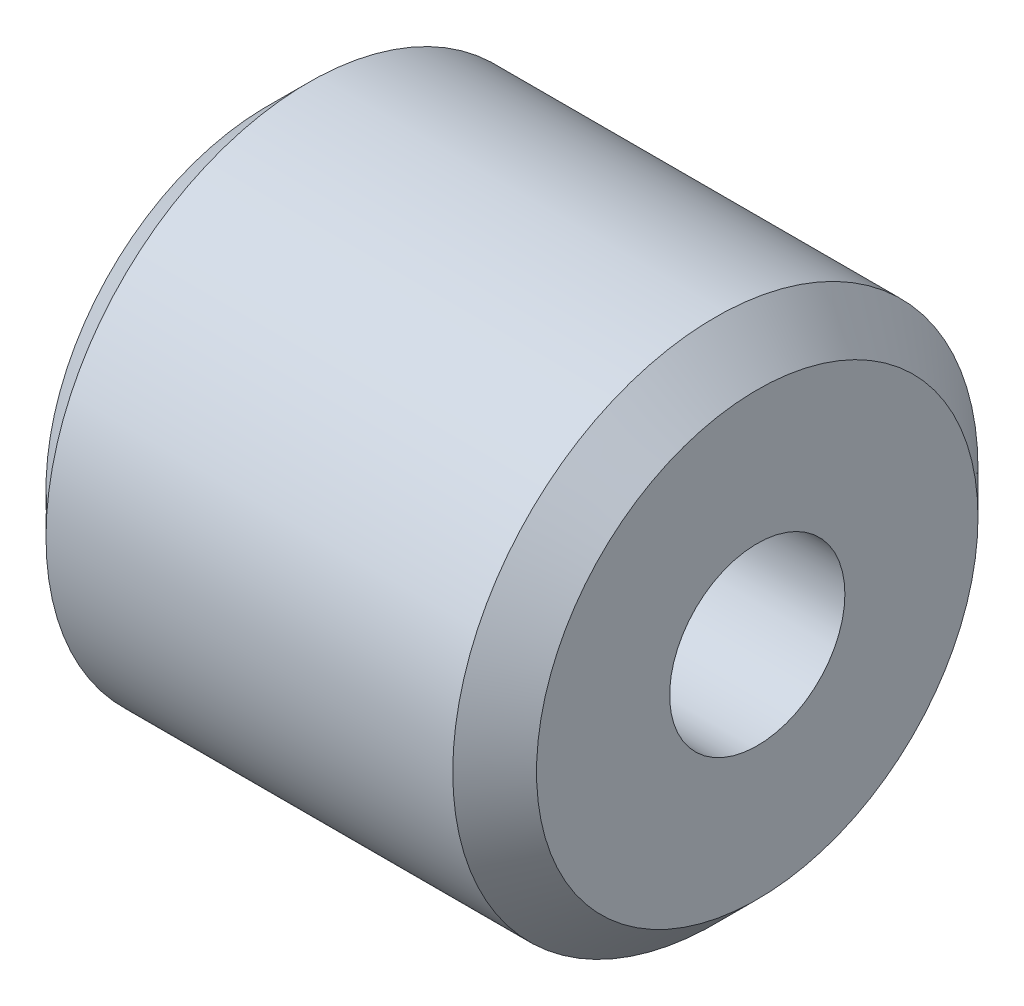
ISO-10303-21;
HEADER;
FILE_DESCRIPTION(('STEP AP214'),'2;1');
FILE_NAME('part.step','',(''),(''),'','','');
FILE_SCHEMA(('AUTOMOTIVE_DESIGN { 1 0 10303 214 1 1 1 1 }'));
ENDSEC;
DATA;
#1=APPLICATION_CONTEXT('core data for automotive mechanical design processes');
#2=APPLICATION_PROTOCOL_DEFINITION('international standard','automotive_design',2000,#1);
#3=PRODUCT_CONTEXT('',#1,'mechanical');
#4=PRODUCT('Part','Part','',(#3));
#5=PRODUCT_RELATED_PRODUCT_CATEGORY('part','',(#4));
#6=PRODUCT_DEFINITION_FORMATION('','',#4);
#7=PRODUCT_DEFINITION_CONTEXT('part definition',#1,'design');
#8=PRODUCT_DEFINITION('design','',#6,#7);
#9=PRODUCT_DEFINITION_SHAPE('','',#8);
#10=(LENGTH_UNIT() NAMED_UNIT(*) SI_UNIT(.MILLI.,.METRE.));
#11=(NAMED_UNIT(*) PLANE_ANGLE_UNIT() SI_UNIT($,.RADIAN.));
#12=(NAMED_UNIT(*) SI_UNIT($,.STERADIAN.) SOLID_ANGLE_UNIT());
#13=UNCERTAINTY_MEASURE_WITH_UNIT(LENGTH_MEASURE(1.E-05),#10,'distance_accuracy_value','');
#14=(GEOMETRIC_REPRESENTATION_CONTEXT(3) GLOBAL_UNCERTAINTY_ASSIGNED_CONTEXT((#13)) GLOBAL_UNIT_ASSIGNED_CONTEXT((#10,
#11,#12)) REPRESENTATION_CONTEXT('',''));
#15=CARTESIAN_POINT('',(0.,0.,0.));
#16=DIRECTION('',(0.,0.,1.));
#17=DIRECTION('',(1.,0.,0.));
#18=AXIS2_PLACEMENT_3D('',#15,#16,#17);
#19=CARTESIAN_POINT('',(4.45,0.,0.));
#20=DIRECTION('',(1.,0.,0.));
#21=DIRECTION('',(0.,0.,-1.));
#22=AXIS2_PLACEMENT_3D('',#19,#20,#21);
#23=PLANE('',#22);
#24=CARTESIAN_POINT('',(4.45,0.,0.));
#25=DIRECTION('',(1.,0.,0.));
#26=DIRECTION('',(0.,0.,-1.));
#27=AXIS2_PLACEMENT_3D('',#24,#25,#26);
#28=CIRCLE('',#27,4.005);
#29=CARTESIAN_POINT('',(4.45,0.,-4.005));
#30=VERTEX_POINT('',#29);
#31=EDGE_CURVE('E10',#30,#30,#28,.T.);
#32=ORIENTED_EDGE('',*,*,#31,.T.);
#33=EDGE_LOOP('',(#32));
#34=FACE_BOUND('',#33,.T.);
#35=CARTESIAN_POINT('',(4.45,0.,0.));
#36=DIRECTION('',(1.,0.,0.));
#37=DIRECTION('',(0.,0.,-1.));
#38=AXIS2_PLACEMENT_3D('',#35,#36,#37);
#39=CIRCLE('',#38,1.59);
#40=CARTESIAN_POINT('',(4.45,0.,-1.59));
#41=VERTEX_POINT('',#40);
#42=EDGE_CURVE('E64',#41,#41,#39,.T.);
#43=ORIENTED_EDGE('',*,*,#42,.F.);
#44=EDGE_LOOP('',(#43));
#45=FACE_BOUND('',#44,.T.);
#46=ADVANCED_FACE('F39',(#34,#45),#23,.T.);
#47=CARTESIAN_POINT('',(-4.45,0.,0.));
#48=DIRECTION('',(1.,0.,0.));
#49=DIRECTION('',(0.,0.,-1.));
#50=AXIS2_PLACEMENT_3D('',#47,#48,#49);
#51=PLANE('',#50);
#52=CARTESIAN_POINT('',(-4.45,0.,0.));
#53=DIRECTION('',(1.,0.,0.));
#54=DIRECTION('',(0.,0.,-1.));
#55=AXIS2_PLACEMENT_3D('',#52,#53,#54);
#56=CIRCLE('',#55,4.00499999999999);
#57=CARTESIAN_POINT('',(-4.45,0.,-4.00499999999999));
#58=VERTEX_POINT('',#57);
#59=EDGE_CURVE('E48',#58,#58,#56,.F.);
#60=ORIENTED_EDGE('',*,*,#59,.T.);
#61=EDGE_LOOP('',(#60));
#62=FACE_BOUND('',#61,.T.);
#63=CARTESIAN_POINT('',(-4.45,0.,0.));
#64=DIRECTION('',(1.,0.,0.));
#65=DIRECTION('',(0.,0.,-1.));
#66=AXIS2_PLACEMENT_3D('',#63,#64,#65);
#67=CIRCLE('',#66,1.59);
#68=CARTESIAN_POINT('',(-4.45,0.,-1.59));
#69=VERTEX_POINT('',#68);
#70=EDGE_CURVE('E65',#69,#69,#67,.T.);
#71=ORIENTED_EDGE('',*,*,#70,.T.);
#72=EDGE_LOOP('',(#71));
#73=FACE_BOUND('',#72,.T.);
#74=ADVANCED_FACE('F77',(#62,#73),#51,.F.);
#75=CARTESIAN_POINT('',(4.45,0.,0.));
#76=DIRECTION('',(-1.,0.,0.));
#77=DIRECTION('',(0.,0.,1.));
#78=AXIS2_PLACEMENT_3D('',#75,#76,#77);
#79=CYLINDRICAL_SURFACE('',#78,4.765);
#80=CARTESIAN_POINT('',(-3.69,0.,0.));
#81=DIRECTION('',(1.,0.,0.));
#82=DIRECTION('',(0.,0.,-1.));
#83=AXIS2_PLACEMENT_3D('',#80,#81,#82);
#84=CIRCLE('',#83,4.765);
#85=CARTESIAN_POINT('',(-3.69,0.,-4.765));
#86=VERTEX_POINT('',#85);
#87=EDGE_CURVE('E53',#86,#86,#84,.T.);
#88=ORIENTED_EDGE('',*,*,#87,.T.);
#89=EDGE_LOOP('',(#88));
#90=FACE_BOUND('',#89,.T.);
#91=CARTESIAN_POINT('',(3.69,0.,0.));
#92=DIRECTION('',(1.,0.,0.));
#93=DIRECTION('',(0.,0.,-1.));
#94=AXIS2_PLACEMENT_3D('',#91,#92,#93);
#95=CIRCLE('',#94,4.765);
#96=CARTESIAN_POINT('',(3.69,0.,-4.765));
#97=VERTEX_POINT('',#96);
#98=EDGE_CURVE('E58',#97,#97,#95,.F.);
#99=ORIENTED_EDGE('',*,*,#98,.T.);
#100=EDGE_LOOP('',(#99));
#101=FACE_BOUND('',#100,.T.);
#102=ADVANCED_FACE('F82',(#90,#101),#79,.T.);
#103=CARTESIAN_POINT('',(4.45,0.,0.));
#104=DIRECTION('',(-1.,0.,0.));
#105=DIRECTION('',(0.,0.,1.));
#106=AXIS2_PLACEMENT_3D('',#103,#104,#105);
#107=CYLINDRICAL_SURFACE('',#106,1.59);
#108=ORIENTED_EDGE('',*,*,#42,.T.);
#109=EDGE_LOOP('',(#108));
#110=FACE_BOUND('',#109,.T.);
#111=ORIENTED_EDGE('',*,*,#70,.F.);
#112=EDGE_LOOP('',(#111));
#113=FACE_BOUND('',#112,.T.);
#114=ADVANCED_FACE('F73',(#110,#113),#107,.F.);
#115=CARTESIAN_POINT('',(-3.69,0.,0.));
#116=DIRECTION('',(1.,0.,0.));
#117=DIRECTION('',(0.,0.,-1.));
#118=AXIS2_PLACEMENT_3D('',#115,#116,#117);
#119=CONICAL_SURFACE('',#118,4.765,0.78539816339745);
#120=ORIENTED_EDGE('',*,*,#59,.F.);
#121=EDGE_LOOP('',(#120));
#122=FACE_BOUND('',#121,.T.);
#123=ORIENTED_EDGE('',*,*,#87,.F.);
#124=EDGE_LOOP('',(#123));
#125=FACE_BOUND('',#124,.T.);
#126=ADVANCED_FACE('F89',(#122,#125),#119,.T.);
#127=CARTESIAN_POINT('',(4.45,0.,0.));
#128=DIRECTION('',(-1.,0.,0.));
#129=DIRECTION('',(0.,0.,1.));
#130=AXIS2_PLACEMENT_3D('',#127,#128,#129);
#131=CONICAL_SURFACE('',#130,4.005,0.785398163397447);
#132=ORIENTED_EDGE('',*,*,#98,.F.);
#133=EDGE_LOOP('',(#132));
#134=FACE_BOUND('',#133,.T.);
#135=ORIENTED_EDGE('',*,*,#31,.F.);
#136=EDGE_LOOP('',(#135));
#137=FACE_BOUND('',#136,.T.);
#138=ADVANCED_FACE('F42',(#134,#137),#131,.T.);
#139=CLOSED_SHELL('',(#46,#74,#102,#114,#126,#138));
#140=MANIFOLD_SOLID_BREP('B2',#139);
#141=ADVANCED_BREP_SHAPE_REPRESENTATION('',(#18,#140),#14);
#142=SHAPE_DEFINITION_REPRESENTATION(#9,#141);
ENDSEC;
END-ISO-10303-21;
